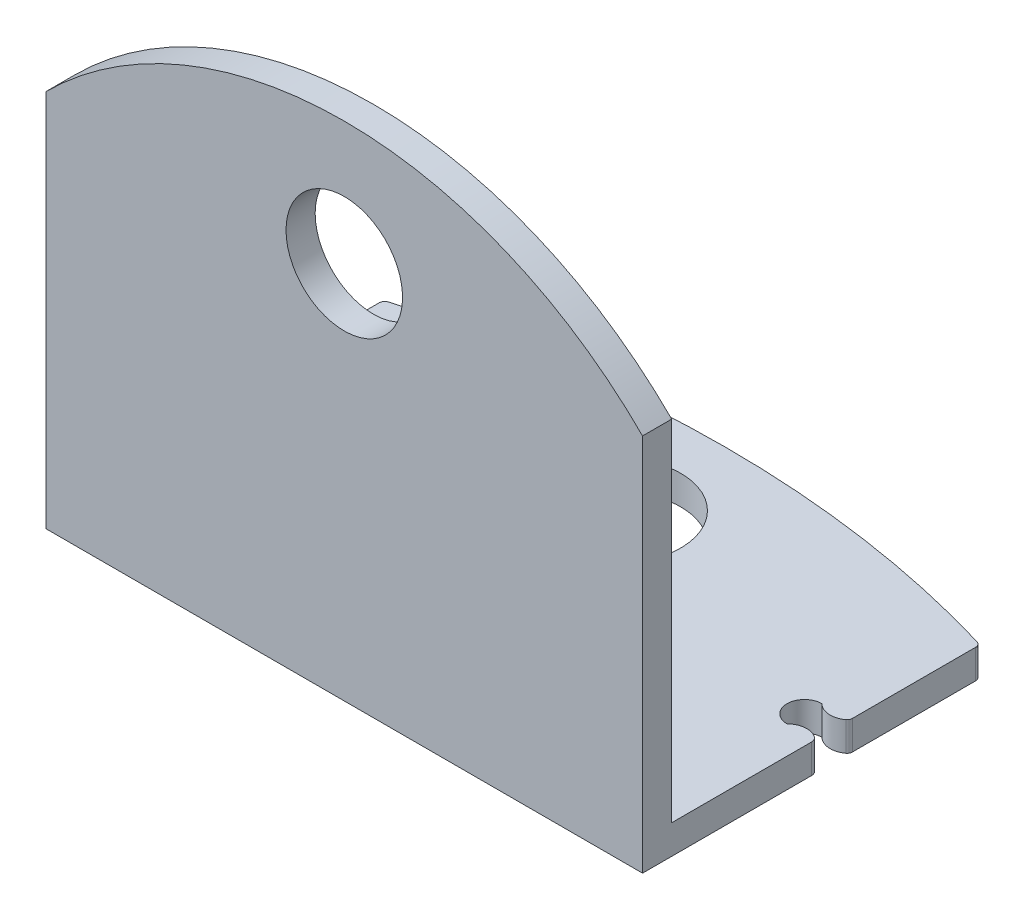
ISO-10303-21;
HEADER;
FILE_DESCRIPTION(('STEP AP214'),'2;1');
FILE_NAME('part.step','',(''),(''),'','','');
FILE_SCHEMA(('AUTOMOTIVE_DESIGN { 1 0 10303 214 1 1 1 1 }'));
ENDSEC;
DATA;
#1=APPLICATION_CONTEXT('core data for automotive mechanical design processes');
#2=APPLICATION_PROTOCOL_DEFINITION('international standard','automotive_design',2000,#1);
#3=PRODUCT_CONTEXT('',#1,'mechanical');
#4=PRODUCT('Part','Part','',(#3));
#5=PRODUCT_RELATED_PRODUCT_CATEGORY('part','',(#4));
#6=PRODUCT_DEFINITION_FORMATION('','',#4);
#7=PRODUCT_DEFINITION_CONTEXT('part definition',#1,'design');
#8=PRODUCT_DEFINITION('design','',#6,#7);
#9=PRODUCT_DEFINITION_SHAPE('','',#8);
#10=(LENGTH_UNIT() NAMED_UNIT(*) SI_UNIT(.MILLI.,.METRE.));
#11=(NAMED_UNIT(*) PLANE_ANGLE_UNIT() SI_UNIT($,.RADIAN.));
#12=(NAMED_UNIT(*) SI_UNIT($,.STERADIAN.) SOLID_ANGLE_UNIT());
#13=UNCERTAINTY_MEASURE_WITH_UNIT(LENGTH_MEASURE(1.E-05),#10,'distance_accuracy_value','');
#14=(GEOMETRIC_REPRESENTATION_CONTEXT(3) GLOBAL_UNCERTAINTY_ASSIGNED_CONTEXT((#13)) GLOBAL_UNIT_ASSIGNED_CONTEXT((#10,
#11,#12)) REPRESENTATION_CONTEXT('',''));
#15=CARTESIAN_POINT('',(0.,0.,0.));
#16=DIRECTION('',(0.,0.,1.));
#17=DIRECTION('',(1.,0.,0.));
#18=AXIS2_PLACEMENT_3D('',#15,#16,#17);
#19=CARTESIAN_POINT('',(-41.3120876337438,1.,-5.33762069757286));
#20=DIRECTION('',(0.,-1.,0.));
#21=DIRECTION('',(0.,0.,-1.));
#22=AXIS2_PLACEMENT_3D('',#19,#20,#21);
#23=PLANE('',#22);
#24=DIRECTION('',(0.,0.,1.));
#25=VECTOR('',#24,1.);
#26=CARTESIAN_POINT('',(-61.59208763374,1.,5.84119356993108));
#27=LINE('',#26,#25);
#28=CARTESIAN_POINT('',(-61.59208763374,1.,0.296178534774445));
#29=VERTEX_POINT('',#28);
#30=CARTESIAN_POINT('',(-61.59208763374,1.,5.0956472536764));
#31=VERTEX_POINT('',#30);
#32=EDGE_CURVE('E47',#29,#31,#27,.T.);
#33=ORIENTED_EDGE('',*,*,#32,.T.);
#34=DIRECTION('',(1.,0.,0.));
#35=VECTOR('',#34,1.);
#36=CARTESIAN_POINT('',(-41.3120876337438,1.,5.0956472536764));
#37=LINE('',#36,#35);
#38=CARTESIAN_POINT('',(-41.1120876337419,1.,5.0956472536764));
#39=VERTEX_POINT('',#38);
#40=EDGE_CURVE('E51',#31,#39,#37,.T.);
#41=ORIENTED_EDGE('',*,*,#40,.T.);
#42=DIRECTION('',(0.,0.,-1.));
#43=VECTOR('',#42,1.);
#44=CARTESIAN_POINT('',(-41.1120876337419,1.,0.296178534774445));
#45=LINE('',#44,#43);
#46=CARTESIAN_POINT('',(-41.1120876337419,1.,0.296178534774445));
#47=VERTEX_POINT('',#46);
#48=EDGE_CURVE('E173',#39,#47,#45,.T.);
#49=ORIENTED_EDGE('',*,*,#48,.T.);
#50=CARTESIAN_POINT('',(-41.3665413174872,1.,0.296178534774445));
#51=DIRECTION('',(0.,1.,0.));
#52=DIRECTION('',(0.,0.,-1.));
#53=AXIS2_PLACEMENT_3D('',#50,#51,#52);
#54=CIRCLE('',#53,0.254453683745325);
#55=CARTESIAN_POINT('',(-41.2313026112398,1.,0.0806392819593604));
#56=VERTEX_POINT('',#55);
#57=EDGE_CURVE('E232',#47,#56,#54,.T.);
#58=ORIENTED_EDGE('',*,*,#57,.T.);
#59=CARTESIAN_POINT('',(-41.5920876337419,1.,0.655647253676407));
#60=DIRECTION('',(0.,1.,0.));
#61=DIRECTION('',(0.,0.,1.));
#62=AXIS2_PLACEMENT_3D('',#59,#60,#61);
#63=CIRCLE('',#62,0.678822509939087);
#64=CARTESIAN_POINT('',(-42.0720876337419,1.,0.1756472536764));
#65=VERTEX_POINT('',#64);
#66=EDGE_CURVE('E234',#56,#65,#63,.T.);
#67=ORIENTED_EDGE('',*,*,#66,.T.);
#68=CARTESIAN_POINT('',(-42.0720876337419,1.,-0.424352746323596));
#69=DIRECTION('',(0.,-1.,0.));
#70=DIRECTION('',(0.,0.,-1.));
#71=AXIS2_PLACEMENT_3D('',#68,#69,#70);
#72=CIRCLE('',#71,0.6);
#73=CARTESIAN_POINT('',(-42.0720876337419,1.,-1.0243527463236));
#74=VERTEX_POINT('',#73);
#75=EDGE_CURVE('E236',#65,#74,#72,.T.);
#76=ORIENTED_EDGE('',*,*,#75,.T.);
#77=CARTESIAN_POINT('',(-41.5920876337419,1.,-1.5043527463236));
#78=DIRECTION('',(0.,1.,0.));
#79=DIRECTION('',(0.,0.,-1.));
#80=AXIS2_PLACEMENT_3D('',#77,#78,#79);
#81=CIRCLE('',#80,0.678822509939086);
#82=CARTESIAN_POINT('',(-41.1838326955143,1.,-0.962017144124402));
#83=VERTEX_POINT('',#82);
#84=EDGE_CURVE('E238',#74,#83,#81,.T.);
#85=ORIENTED_EDGE('',*,*,#84,.T.);
#86=CARTESIAN_POINT('',(-41.2920876337438,1.,-1.10582558737072));
#87=DIRECTION('',(0.,1.,0.));
#88=DIRECTION('',(0.,0.,-1.));
#89=AXIS2_PLACEMENT_3D('',#86,#87,#88);
#90=CIRCLE('',#89,0.18);
#91=CARTESIAN_POINT('',(-41.1120876337438,1.,-1.10582558737155));
#92=VERTEX_POINT('',#91);
#93=EDGE_CURVE('E240',#83,#92,#90,.T.);
#94=ORIENTED_EDGE('',*,*,#93,.T.);
#95=DIRECTION('',(0.,0.,-1.));
#96=VECTOR('',#95,1.);
#97=CARTESIAN_POINT('',(-41.1120876337438,1.,-5.33762069757286));
#98=LINE('',#97,#96);
#99=CARTESIAN_POINT('',(-41.1120876337438,1.,-5.33762069757286));
#100=VERTEX_POINT('',#99);
#101=EDGE_CURVE('E242',#92,#100,#98,.T.);
#102=ORIENTED_EDGE('',*,*,#101,.T.);
#103=CARTESIAN_POINT('',(-41.3120876337438,1.,-5.33762069757286));
#104=DIRECTION('',(0.,1.,0.));
#105=DIRECTION('',(0.,0.,-1.));
#106=AXIS2_PLACEMENT_3D('',#103,#104,#105);
#107=CIRCLE('',#106,0.199999999999998);
#108=CARTESIAN_POINT('',(-41.25522843489,1.,-5.52936800917255));
#109=VERTEX_POINT('',#108);
#110=EDGE_CURVE('E210',#100,#109,#107,.T.);
#111=ORIENTED_EDGE('',*,*,#110,.T.);
#112=CARTESIAN_POINT('',(-51.3520876337428,1.,28.5204541130068));
#113=DIRECTION('',(0.,1.,0.));
#114=DIRECTION('',(0.,0.,1.));
#115=AXIS2_PLACEMENT_3D('',#112,#113,#114);
#116=CIRCLE('',#115,35.5153058868077);
#117=CARTESIAN_POINT('',(-61.4489468325938,1.,-5.52936800917311));
#118=VERTEX_POINT('',#117);
#119=EDGE_CURVE('E213',#109,#118,#116,.T.);
#120=ORIENTED_EDGE('',*,*,#119,.T.);
#121=CARTESIAN_POINT('',(-61.39208763374,1.,-5.33762069757343));
#122=DIRECTION('',(0.,1.,0.));
#123=DIRECTION('',(0.,0.,-1.));
#124=AXIS2_PLACEMENT_3D('',#121,#122,#123);
#125=CIRCLE('',#124,0.199999999999998);
#126=CARTESIAN_POINT('',(-61.59208763374,1.,-5.33762069757343));
#127=VERTEX_POINT('',#126);
#128=EDGE_CURVE('E216',#118,#127,#125,.T.);
#129=ORIENTED_EDGE('',*,*,#128,.T.);
#130=DIRECTION('',(0.,0.,1.));
#131=VECTOR('',#130,1.);
#132=CARTESIAN_POINT('',(-61.59208763374,1.,-5.33762069757343));
#133=LINE('',#132,#131);
#134=CARTESIAN_POINT('',(-61.59208763374,1.,-1.10582558737213));
#135=VERTEX_POINT('',#134);
#136=EDGE_CURVE('E218',#127,#135,#133,.T.);
#137=ORIENTED_EDGE('',*,*,#136,.T.);
#138=CARTESIAN_POINT('',(-61.41208763374,1.,-1.10582558737213));
#139=DIRECTION('',(0.,1.,0.));
#140=DIRECTION('',(0.,0.,1.));
#141=AXIS2_PLACEMENT_3D('',#138,#139,#140);
#142=CIRCLE('',#141,0.18);
#143=CARTESIAN_POINT('',(-61.5203425719676,1.,-0.962017144124399));
#144=VERTEX_POINT('',#143);
#145=EDGE_CURVE('E220',#135,#144,#142,.T.);
#146=ORIENTED_EDGE('',*,*,#145,.T.);
#147=CARTESIAN_POINT('',(-61.11208763374,1.,-1.5043527463236));
#148=DIRECTION('',(0.,1.,0.));
#149=DIRECTION('',(0.,0.,1.));
#150=AXIS2_PLACEMENT_3D('',#147,#148,#149);
#151=CIRCLE('',#150,0.678822509939086);
#152=CARTESIAN_POINT('',(-60.63208763374,1.,-1.02435274632359));
#153=VERTEX_POINT('',#152);
#154=EDGE_CURVE('E222',#144,#153,#151,.T.);
#155=ORIENTED_EDGE('',*,*,#154,.T.);
#156=CARTESIAN_POINT('',(-60.63208763374,1.,-0.424352746323596));
#157=DIRECTION('',(0.,-1.,0.));
#158=DIRECTION('',(0.,0.,1.));
#159=AXIS2_PLACEMENT_3D('',#156,#157,#158);
#160=CIRCLE('',#159,0.6);
#161=CARTESIAN_POINT('',(-60.63208763374,1.,0.175647253676404));
#162=VERTEX_POINT('',#161);
#163=EDGE_CURVE('E224',#153,#162,#160,.T.);
#164=ORIENTED_EDGE('',*,*,#163,.T.);
#165=CARTESIAN_POINT('',(-61.11208763374,1.,0.655647253676407));
#166=DIRECTION('',(0.,1.,0.));
#167=DIRECTION('',(0.,0.,-1.));
#168=AXIS2_PLACEMENT_3D('',#165,#166,#167);
#169=CIRCLE('',#168,0.678822509939085);
#170=CARTESIAN_POINT('',(-61.4728726562421,1.,0.0806392819593631));
#171=VERTEX_POINT('',#170);
#172=EDGE_CURVE('E226',#162,#171,#169,.T.);
#173=ORIENTED_EDGE('',*,*,#172,.T.);
#174=CARTESIAN_POINT('',(-61.3376339499947,1.,0.296178534774445));
#175=DIRECTION('',(0.,1.,0.));
#176=DIRECTION('',(0.,0.,1.));
#177=AXIS2_PLACEMENT_3D('',#174,#175,#176);
#178=CIRCLE('',#177,0.254453683745325);
#179=EDGE_CURVE('E228',#171,#29,#178,.T.);
#180=ORIENTED_EDGE('',*,*,#179,.T.);
#181=EDGE_LOOP('',(#33,#41,#49,#58,#67,#76,#85,#94,#102,#111,#120,#129,#137,#146,#155,#164,#173,#180));
#182=FACE_BOUND('',#181,.T.);
#183=CARTESIAN_POINT('',(-51.3520876337419,1.,-3.2217231424722));
#184=DIRECTION('',(0.,1.,0.));
#185=DIRECTION('',(0.,0.,1.));
#186=AXIS2_PLACEMENT_3D('',#183,#184,#185);
#187=CIRCLE('',#186,2.22857889915405);
#188=CARTESIAN_POINT('',(-51.3520876337419,1.,-0.993144243318159));
#189=VERTEX_POINT('',#188);
#190=EDGE_CURVE('E204',#189,#189,#187,.T.);
#191=ORIENTED_EDGE('',*,*,#190,.F.);
#192=EDGE_LOOP('',(#191));
#193=FACE_BOUND('',#192,.T.);
#194=ADVANCED_FACE('F32',(#182,#193),#23,.F.);
#195=CARTESIAN_POINT('',(-41.3120876337438,0.,-5.33762069757286));
#196=DIRECTION('',(0.,-1.,0.));
#197=DIRECTION('',(0.,0.,-1.));
#198=AXIS2_PLACEMENT_3D('',#195,#196,#197);
#199=PLANE('',#198);
#200=CARTESIAN_POINT('',(-41.3665413174872,0.,0.296178534774445));
#201=DIRECTION('',(0.,1.,0.));
#202=DIRECTION('',(0.,0.,-1.));
#203=AXIS2_PLACEMENT_3D('',#200,#201,#202);
#204=CIRCLE('',#203,0.254453683745325);
#205=CARTESIAN_POINT('',(-41.1120876337419,0.,0.296178534774445));
#206=VERTEX_POINT('',#205);
#207=CARTESIAN_POINT('',(-41.2313026112398,0.,0.0806392819593604));
#208=VERTEX_POINT('',#207);
#209=EDGE_CURVE('E269',#206,#208,#204,.T.);
#210=ORIENTED_EDGE('',*,*,#209,.F.);
#211=DIRECTION('',(0.,0.,-1.));
#212=VECTOR('',#211,1.);
#213=CARTESIAN_POINT('',(-41.1120876337419,0.,0.296178534774445));
#214=LINE('',#213,#212);
#215=CARTESIAN_POINT('',(-41.1120876337419,0.,6.0956472536764));
#216=VERTEX_POINT('',#215);
#217=EDGE_CURVE('E267',#216,#206,#214,.T.);
#218=ORIENTED_EDGE('',*,*,#217,.F.);
#219=DIRECTION('',(1.,0.,0.));
#220=VECTOR('',#219,1.);
#221=CARTESIAN_POINT('',(-61.3376339499947,0.,6.0956472536764));
#222=LINE('',#221,#220);
#223=CARTESIAN_POINT('',(-61.59208763374,0.,6.0956472536764));
#224=VERTEX_POINT('',#223);
#225=EDGE_CURVE('E265',#224,#216,#222,.T.);
#226=ORIENTED_EDGE('',*,*,#225,.F.);
#227=DIRECTION('',(0.,0.,1.));
#228=VECTOR('',#227,1.);
#229=CARTESIAN_POINT('',(-61.59208763374,0.,5.84119356993108));
#230=LINE('',#229,#228);
#231=CARTESIAN_POINT('',(-61.59208763374,0.,0.296178534774445));
#232=VERTEX_POINT('',#231);
#233=EDGE_CURVE('E263',#232,#224,#230,.T.);
#234=ORIENTED_EDGE('',*,*,#233,.F.);
#235=CARTESIAN_POINT('',(-61.3376339499947,0.,0.296178534774445));
#236=DIRECTION('',(0.,1.,0.));
#237=DIRECTION('',(0.,0.,1.));
#238=AXIS2_PLACEMENT_3D('',#235,#236,#237);
#239=CIRCLE('',#238,0.254453683745325);
#240=CARTESIAN_POINT('',(-61.4728726562421,0.,0.0806392819593631));
#241=VERTEX_POINT('',#240);
#242=EDGE_CURVE('E261',#241,#232,#239,.T.);
#243=ORIENTED_EDGE('',*,*,#242,.F.);
#244=CARTESIAN_POINT('',(-61.11208763374,0.,0.655647253676407));
#245=DIRECTION('',(0.,1.,0.));
#246=DIRECTION('',(0.,0.,-1.));
#247=AXIS2_PLACEMENT_3D('',#244,#245,#246);
#248=CIRCLE('',#247,0.678822509939085);
#249=CARTESIAN_POINT('',(-60.63208763374,0.,0.175647253676404));
#250=VERTEX_POINT('',#249);
#251=EDGE_CURVE('E259',#250,#241,#248,.T.);
#252=ORIENTED_EDGE('',*,*,#251,.F.);
#253=CARTESIAN_POINT('',(-60.63208763374,0.,-0.424352746323596));
#254=DIRECTION('',(0.,-1.,0.));
#255=DIRECTION('',(0.,0.,1.));
#256=AXIS2_PLACEMENT_3D('',#253,#254,#255);
#257=CIRCLE('',#256,0.6);
#258=CARTESIAN_POINT('',(-60.63208763374,0.,-1.02435274632359));
#259=VERTEX_POINT('',#258);
#260=EDGE_CURVE('E257',#259,#250,#257,.T.);
#261=ORIENTED_EDGE('',*,*,#260,.F.);
#262=CARTESIAN_POINT('',(-61.11208763374,0.,-1.5043527463236));
#263=DIRECTION('',(0.,1.,0.));
#264=DIRECTION('',(0.,0.,1.));
#265=AXIS2_PLACEMENT_3D('',#262,#263,#264);
#266=CIRCLE('',#265,0.678822509939086);
#267=CARTESIAN_POINT('',(-61.5203425719676,0.,-0.962017144124399));
#268=VERTEX_POINT('',#267);
#269=EDGE_CURVE('E255',#268,#259,#266,.T.);
#270=ORIENTED_EDGE('',*,*,#269,.F.);
#271=CARTESIAN_POINT('',(-61.41208763374,0.,-1.10582558737213));
#272=DIRECTION('',(0.,1.,0.));
#273=DIRECTION('',(0.,0.,1.));
#274=AXIS2_PLACEMENT_3D('',#271,#272,#273);
#275=CIRCLE('',#274,0.18);
#276=CARTESIAN_POINT('',(-61.59208763374,0.,-1.10582558737213));
#277=VERTEX_POINT('',#276);
#278=EDGE_CURVE('E253',#277,#268,#275,.T.);
#279=ORIENTED_EDGE('',*,*,#278,.F.);
#280=DIRECTION('',(0.,0.,1.));
#281=VECTOR('',#280,1.);
#282=CARTESIAN_POINT('',(-61.59208763374,0.,-5.33762069757343));
#283=LINE('',#282,#281);
#284=CARTESIAN_POINT('',(-61.59208763374,0.,-5.33762069757343));
#285=VERTEX_POINT('',#284);
#286=EDGE_CURVE('E251',#285,#277,#283,.T.);
#287=ORIENTED_EDGE('',*,*,#286,.F.);
#288=CARTESIAN_POINT('',(-61.39208763374,0.,-5.33762069757343));
#289=DIRECTION('',(0.,1.,0.));
#290=DIRECTION('',(0.,0.,-1.));
#291=AXIS2_PLACEMENT_3D('',#288,#289,#290);
#292=CIRCLE('',#291,0.199999999999998);
#293=CARTESIAN_POINT('',(-61.4489468325938,0.,-5.52936800917311));
#294=VERTEX_POINT('',#293);
#295=EDGE_CURVE('E249',#294,#285,#292,.T.);
#296=ORIENTED_EDGE('',*,*,#295,.F.);
#297=CARTESIAN_POINT('',(-51.3520876337428,0.,28.5204541130068));
#298=DIRECTION('',(0.,1.,0.));
#299=DIRECTION('',(0.,0.,1.));
#300=AXIS2_PLACEMENT_3D('',#297,#298,#299);
#301=CIRCLE('',#300,35.5153058868077);
#302=CARTESIAN_POINT('',(-41.25522843489,0.,-5.52936800917255));
#303=VERTEX_POINT('',#302);
#304=EDGE_CURVE('E247',#303,#294,#301,.T.);
#305=ORIENTED_EDGE('',*,*,#304,.F.);
#306=CARTESIAN_POINT('',(-41.3120876337438,0.,-5.33762069757286));
#307=DIRECTION('',(0.,1.,0.));
#308=DIRECTION('',(0.,0.,-1.));
#309=AXIS2_PLACEMENT_3D('',#306,#307,#308);
#310=CIRCLE('',#309,0.199999999999998);
#311=CARTESIAN_POINT('',(-41.1120876337438,0.,-5.33762069757286));
#312=VERTEX_POINT('',#311);
#313=EDGE_CURVE('E207',#312,#303,#310,.T.);
#314=ORIENTED_EDGE('',*,*,#313,.F.);
#315=DIRECTION('',(0.,0.,-1.));
#316=VECTOR('',#315,1.);
#317=CARTESIAN_POINT('',(-41.1120876337438,0.,-5.33762069757286));
#318=LINE('',#317,#316);
#319=CARTESIAN_POINT('',(-41.1120876337438,0.,-1.10582558737155));
#320=VERTEX_POINT('',#319);
#321=EDGE_CURVE('E214',#320,#312,#318,.T.);
#322=ORIENTED_EDGE('',*,*,#321,.F.);
#323=CARTESIAN_POINT('',(-41.2920876337438,0.,-1.10582558737072));
#324=DIRECTION('',(0.,1.,0.));
#325=DIRECTION('',(0.,0.,-1.));
#326=AXIS2_PLACEMENT_3D('',#323,#324,#325);
#327=CIRCLE('',#326,0.18);
#328=CARTESIAN_POINT('',(-41.1838326955143,0.,-0.962017144124402));
#329=VERTEX_POINT('',#328);
#330=EDGE_CURVE('E277',#329,#320,#327,.T.);
#331=ORIENTED_EDGE('',*,*,#330,.F.);
#332=CARTESIAN_POINT('',(-41.5920876337419,0.,-1.5043527463236));
#333=DIRECTION('',(0.,1.,0.));
#334=DIRECTION('',(0.,0.,-1.));
#335=AXIS2_PLACEMENT_3D('',#332,#333,#334);
#336=CIRCLE('',#335,0.678822509939086);
#337=CARTESIAN_POINT('',(-42.0720876337419,0.,-1.0243527463236));
#338=VERTEX_POINT('',#337);
#339=EDGE_CURVE('E275',#338,#329,#336,.T.);
#340=ORIENTED_EDGE('',*,*,#339,.F.);
#341=CARTESIAN_POINT('',(-42.0720876337419,0.,-0.424352746323596));
#342=DIRECTION('',(0.,-1.,0.));
#343=DIRECTION('',(0.,0.,-1.));
#344=AXIS2_PLACEMENT_3D('',#341,#342,#343);
#345=CIRCLE('',#344,0.6);
#346=CARTESIAN_POINT('',(-42.0720876337419,0.,0.1756472536764));
#347=VERTEX_POINT('',#346);
#348=EDGE_CURVE('E273',#347,#338,#345,.T.);
#349=ORIENTED_EDGE('',*,*,#348,.F.);
#350=CARTESIAN_POINT('',(-41.5920876337419,0.,0.655647253676407));
#351=DIRECTION('',(0.,1.,0.));
#352=DIRECTION('',(0.,0.,1.));
#353=AXIS2_PLACEMENT_3D('',#350,#351,#352);
#354=CIRCLE('',#353,0.678822509939087);
#355=EDGE_CURVE('E271',#208,#347,#354,.T.);
#356=ORIENTED_EDGE('',*,*,#355,.F.);
#357=EDGE_LOOP('',(#210,#218,#226,#234,#243,#252,#261,#270,#279,#287,#296,#305,#314,#322,#331,
#340,#349,#356));
#358=FACE_BOUND('',#357,.T.);
#359=CARTESIAN_POINT('',(-51.3520876337419,0.,-3.2217231424722));
#360=DIRECTION('',(0.,1.,0.));
#361=DIRECTION('',(0.,0.,1.));
#362=AXIS2_PLACEMENT_3D('',#359,#360,#361);
#363=CIRCLE('',#362,2.22857889915405);
#364=CARTESIAN_POINT('',(-51.3520876337419,0.,-0.993144243318159));
#365=VERTEX_POINT('',#364);
#366=EDGE_CURVE('E203',#365,#365,#363,.T.);
#367=ORIENTED_EDGE('',*,*,#366,.T.);
#368=EDGE_LOOP('',(#367));
#369=FACE_BOUND('',#368,.T.);
#370=ADVANCED_FACE('F331',(#358,#369),#199,.T.);
#371=CARTESIAN_POINT('',(-41.3120876337438,1.,-5.33762069757286));
#372=DIRECTION('',(0.,-1.,0.));
#373=DIRECTION('',(0.,0.,-1.));
#374=AXIS2_PLACEMENT_3D('',#371,#372,#373);
#375=CYLINDRICAL_SURFACE('',#374,0.199999999999998);
#376=ORIENTED_EDGE('',*,*,#313,.T.);
#377=DIRECTION('',(0.,-1.,0.));
#378=VECTOR('',#377,1.);
#379=CARTESIAN_POINT('',(-41.25522843489,1.,-5.52936800917255));
#380=LINE('',#379,#378);
#381=EDGE_CURVE('E11',#109,#303,#380,.T.);
#382=ORIENTED_EDGE('',*,*,#381,.F.);
#383=ORIENTED_EDGE('',*,*,#110,.F.);
#384=DIRECTION('',(0.,-1.,0.));
#385=VECTOR('',#384,1.);
#386=CARTESIAN_POINT('',(-41.1120876337438,1.,-5.33762069757286));
#387=LINE('',#386,#385);
#388=EDGE_CURVE('E244',#100,#312,#387,.T.);
#389=ORIENTED_EDGE('',*,*,#388,.T.);
#390=EDGE_LOOP('',(#376,#382,#383,#389));
#391=FACE_BOUND('',#390,.T.);
#392=ADVANCED_FACE('F34',(#391),#375,.T.);
#393=CARTESIAN_POINT('',(-51.3520876337428,1.,28.5204541130068));
#394=DIRECTION('',(0.,-1.,0.));
#395=DIRECTION('',(0.,0.,-1.));
#396=AXIS2_PLACEMENT_3D('',#393,#394,#395);
#397=CYLINDRICAL_SURFACE('',#396,35.5153058868077);
#398=ORIENTED_EDGE('',*,*,#304,.T.);
#399=DIRECTION('',(0.,-1.,0.));
#400=VECTOR('',#399,1.);
#401=CARTESIAN_POINT('',(-61.4489468325938,1.,-5.52936800917311));
#402=LINE('',#401,#400);
#403=EDGE_CURVE('E40',#118,#294,#402,.T.);
#404=ORIENTED_EDGE('',*,*,#403,.F.);
#405=ORIENTED_EDGE('',*,*,#119,.F.);
#406=ORIENTED_EDGE('',*,*,#381,.T.);
#407=EDGE_LOOP('',(#398,#404,#405,#406));
#408=FACE_BOUND('',#407,.T.);
#409=ADVANCED_FACE('F349',(#408),#397,.T.);
#410=CARTESIAN_POINT('',(-61.39208763374,1.,-5.33762069757343));
#411=DIRECTION('',(0.,-1.,0.));
#412=DIRECTION('',(0.,0.,-1.));
#413=AXIS2_PLACEMENT_3D('',#410,#411,#412);
#414=CYLINDRICAL_SURFACE('',#413,0.199999999999998);
#415=ORIENTED_EDGE('',*,*,#295,.T.);
#416=DIRECTION('',(0.,-1.,0.));
#417=VECTOR('',#416,1.);
#418=CARTESIAN_POINT('',(-61.59208763374,1.,-5.33762069757343));
#419=LINE('',#418,#417);
#420=EDGE_CURVE('E318',#127,#285,#419,.T.);
#421=ORIENTED_EDGE('',*,*,#420,.F.);
#422=ORIENTED_EDGE('',*,*,#128,.F.);
#423=ORIENTED_EDGE('',*,*,#403,.T.);
#424=EDGE_LOOP('',(#415,#421,#422,#423));
#425=FACE_BOUND('',#424,.T.);
#426=ADVANCED_FACE('F325',(#425),#414,.T.);
#427=CARTESIAN_POINT('',(-61.59208763374,1.,-5.33762069757343));
#428=DIRECTION('',(1.,0.,0.));
#429=DIRECTION('',(0.,0.,-1.));
#430=AXIS2_PLACEMENT_3D('',#427,#428,#429);
#431=PLANE('',#430);
#432=ORIENTED_EDGE('',*,*,#286,.T.);
#433=DIRECTION('',(0.,-1.,0.));
#434=VECTOR('',#433,1.);
#435=CARTESIAN_POINT('',(-61.59208763374,1.,-1.10582558737213));
#436=LINE('',#435,#434);
#437=EDGE_CURVE('E315',#135,#277,#436,.T.);
#438=ORIENTED_EDGE('',*,*,#437,.F.);
#439=ORIENTED_EDGE('',*,*,#136,.F.);
#440=ORIENTED_EDGE('',*,*,#420,.T.);
#441=EDGE_LOOP('',(#432,#438,#439,#440));
#442=FACE_BOUND('',#441,.T.);
#443=ADVANCED_FACE('F338',(#442),#431,.F.);
#444=CARTESIAN_POINT('',(-61.41208763374,1.,-1.10582558737213));
#445=DIRECTION('',(0.,-1.,0.));
#446=DIRECTION('',(0.,0.,-1.));
#447=AXIS2_PLACEMENT_3D('',#444,#445,#446);
#448=CYLINDRICAL_SURFACE('',#447,0.18);
#449=ORIENTED_EDGE('',*,*,#278,.T.);
#450=DIRECTION('',(0.,-1.,0.));
#451=VECTOR('',#450,1.);
#452=CARTESIAN_POINT('',(-61.5203425719676,1.,-0.962017144124399));
#453=LINE('',#452,#451);
#454=EDGE_CURVE('E312',#144,#268,#453,.T.);
#455=ORIENTED_EDGE('',*,*,#454,.F.);
#456=ORIENTED_EDGE('',*,*,#145,.F.);
#457=ORIENTED_EDGE('',*,*,#437,.T.);
#458=EDGE_LOOP('',(#449,#455,#456,#457));
#459=FACE_BOUND('',#458,.T.);
#460=ADVANCED_FACE('F342',(#459),#448,.T.);
#461=CARTESIAN_POINT('',(-61.11208763374,1.,-1.5043527463236));
#462=DIRECTION('',(0.,-1.,0.));
#463=DIRECTION('',(0.,0.,-1.));
#464=AXIS2_PLACEMENT_3D('',#461,#462,#463);
#465=CYLINDRICAL_SURFACE('',#464,0.678822509939086);
#466=ORIENTED_EDGE('',*,*,#269,.T.);
#467=DIRECTION('',(0.,-1.,0.));
#468=VECTOR('',#467,1.);
#469=CARTESIAN_POINT('',(-60.63208763374,1.,-1.02435274632359));
#470=LINE('',#469,#468);
#471=EDGE_CURVE('E309',#153,#259,#470,.T.);
#472=ORIENTED_EDGE('',*,*,#471,.F.);
#473=ORIENTED_EDGE('',*,*,#154,.F.);
#474=ORIENTED_EDGE('',*,*,#454,.T.);
#475=EDGE_LOOP('',(#466,#472,#473,#474));
#476=FACE_BOUND('',#475,.T.);
#477=ADVANCED_FACE('F404',(#476),#465,.T.);
#478=CARTESIAN_POINT('',(-60.63208763374,1.,-0.424352746323596));
#479=DIRECTION('',(0.,-1.,0.));
#480=DIRECTION('',(0.,0.,-1.));
#481=AXIS2_PLACEMENT_3D('',#478,#479,#480);
#482=CYLINDRICAL_SURFACE('',#481,0.6);
#483=ORIENTED_EDGE('',*,*,#260,.T.);
#484=DIRECTION('',(0.,-1.,0.));
#485=VECTOR('',#484,1.);
#486=CARTESIAN_POINT('',(-60.63208763374,1.,0.175647253676404));
#487=LINE('',#486,#485);
#488=EDGE_CURVE('E306',#162,#250,#487,.T.);
#489=ORIENTED_EDGE('',*,*,#488,.F.);
#490=ORIENTED_EDGE('',*,*,#163,.F.);
#491=ORIENTED_EDGE('',*,*,#471,.T.);
#492=EDGE_LOOP('',(#483,#489,#490,#491));
#493=FACE_BOUND('',#492,.T.);
#494=ADVANCED_FACE('F402',(#493),#482,.F.);
#495=CARTESIAN_POINT('',(-61.11208763374,1.,0.655647253676407));
#496=DIRECTION('',(0.,-1.,0.));
#497=DIRECTION('',(0.,0.,-1.));
#498=AXIS2_PLACEMENT_3D('',#495,#496,#497);
#499=CYLINDRICAL_SURFACE('',#498,0.678822509939085);
#500=ORIENTED_EDGE('',*,*,#251,.T.);
#501=DIRECTION('',(0.,-1.,0.));
#502=VECTOR('',#501,1.);
#503=CARTESIAN_POINT('',(-61.4728726562421,1.,0.0806392819593631));
#504=LINE('',#503,#502);
#505=EDGE_CURVE('E303',#171,#241,#504,.T.);
#506=ORIENTED_EDGE('',*,*,#505,.F.);
#507=ORIENTED_EDGE('',*,*,#172,.F.);
#508=ORIENTED_EDGE('',*,*,#488,.T.);
#509=EDGE_LOOP('',(#500,#506,#507,#508));
#510=FACE_BOUND('',#509,.T.);
#511=ADVANCED_FACE('F398',(#510),#499,.T.);
#512=CARTESIAN_POINT('',(-61.3376339499947,1.,0.296178534774445));
#513=DIRECTION('',(0.,-1.,0.));
#514=DIRECTION('',(0.,0.,-1.));
#515=AXIS2_PLACEMENT_3D('',#512,#513,#514);
#516=CYLINDRICAL_SURFACE('',#515,0.254453683745325);
#517=ORIENTED_EDGE('',*,*,#242,.T.);
#518=DIRECTION('',(0.,-1.,0.));
#519=VECTOR('',#518,1.);
#520=CARTESIAN_POINT('',(-61.59208763374,1.,0.296178534774445));
#521=LINE('',#520,#519);
#522=EDGE_CURVE('E300',#29,#232,#521,.T.);
#523=ORIENTED_EDGE('',*,*,#522,.F.);
#524=ORIENTED_EDGE('',*,*,#179,.F.);
#525=ORIENTED_EDGE('',*,*,#505,.T.);
#526=EDGE_LOOP('',(#517,#523,#524,#525));
#527=FACE_BOUND('',#526,.T.);
#528=ADVANCED_FACE('F393',(#527),#516,.T.);
#529=CARTESIAN_POINT('',(-61.59208763374,1.,5.84119356993108));
#530=DIRECTION('',(1.,0.,0.));
#531=DIRECTION('',(0.,0.,-1.));
#532=AXIS2_PLACEMENT_3D('',#529,#530,#531);
#533=PLANE('',#532);
#534=DIRECTION('',(0.,-1.,0.));
#535=VECTOR('',#534,1.);
#536=CARTESIAN_POINT('',(-61.59208763374,0.,5.0956472536764));
#537=LINE('',#536,#535);
#538=CARTESIAN_POINT('',(-61.59208763374,13.,5.0956472536764));
#539=VERTEX_POINT('',#538);
#540=EDGE_CURVE('E187',#539,#31,#537,.T.);
#541=ORIENTED_EDGE('',*,*,#540,.T.);
#542=ORIENTED_EDGE('',*,*,#32,.F.);
#543=ORIENTED_EDGE('',*,*,#522,.T.);
#544=ORIENTED_EDGE('',*,*,#233,.T.);
#545=DIRECTION('',(0.,-1.,0.));
#546=VECTOR('',#545,1.);
#547=CARTESIAN_POINT('',(-61.59208763374,0.,6.0956472536764));
#548=LINE('',#547,#546);
#549=CARTESIAN_POINT('',(-61.59208763374,13.,6.0956472536764));
#550=VERTEX_POINT('',#549);
#551=EDGE_CURVE('E177',#550,#224,#548,.T.);
#552=ORIENTED_EDGE('',*,*,#551,.F.);
#553=DIRECTION('',(0.,0.,1.));
#554=VECTOR('',#553,1.);
#555=CARTESIAN_POINT('',(-61.59208763374,13.,5.0956472536764));
#556=LINE('',#555,#554);
#557=EDGE_CURVE('E186',#539,#550,#556,.T.);
#558=ORIENTED_EDGE('',*,*,#557,.F.);
#559=EDGE_LOOP('',(#541,#542,#543,#544,#552,#558));
#560=FACE_BOUND('',#559,.T.);
#561=ADVANCED_FACE('F387',(#560),#533,.F.);
#562=CARTESIAN_POINT('',(-61.3376339499947,1.,6.0956472536764));
#563=DIRECTION('',(0.,0.,-1.));
#564=DIRECTION('',(-1.,0.,0.));
#565=AXIS2_PLACEMENT_3D('',#562,#563,#564);
#566=PLANE('',#565);
#567=CARTESIAN_POINT('',(-51.352087633741,13.,6.0956472536764));
#568=DIRECTION('',(0.,0.,-1.));
#569=DIRECTION('',(-1.,0.,0.));
#570=AXIS2_PLACEMENT_3D('',#567,#568,#569);
#571=CIRCLE('',#570,2.);
#572=CARTESIAN_POINT('',(-53.352087633741,13.,6.0956472536764));
#573=VERTEX_POINT('',#572);
#574=EDGE_CURVE('E197',#573,#573,#571,.T.);
#575=ORIENTED_EDGE('',*,*,#574,.T.);
#576=EDGE_LOOP('',(#575));
#577=FACE_BOUND('',#576,.T.);
#578=ORIENTED_EDGE('',*,*,#551,.T.);
#579=ORIENTED_EDGE('',*,*,#225,.T.);
#580=DIRECTION('',(0.,1.,0.));
#581=VECTOR('',#580,1.);
#582=CARTESIAN_POINT('',(-41.1120876337419,0.,6.0956472536764));
#583=LINE('',#582,#581);
#584=CARTESIAN_POINT('',(-41.1120876337419,13.,6.0956472536764));
#585=VERTEX_POINT('',#584);
#586=EDGE_CURVE('E195',#216,#585,#583,.T.);
#587=ORIENTED_EDGE('',*,*,#586,.T.);
#588=CARTESIAN_POINT('',(-51.352087633741,2.76000000000093,6.0956472536764));
#589=DIRECTION('',(0.,0.,1.));
#590=DIRECTION('',(-1.,0.,0.));
#591=AXIS2_PLACEMENT_3D('',#588,#589,#590);
#592=CIRCLE('',#591,14.4815468786992);
#593=EDGE_CURVE('E184',#585,#550,#592,.T.);
#594=ORIENTED_EDGE('',*,*,#593,.T.);
#595=EDGE_LOOP('',(#578,#579,#587,#594));
#596=FACE_BOUND('',#595,.T.);
#597=ADVANCED_FACE('F384',(#577,#596),#566,.F.);
#598=CARTESIAN_POINT('',(-41.1120876337419,1.,0.296178534774445));
#599=DIRECTION('',(-1.,0.,0.));
#600=DIRECTION('',(0.,0.,1.));
#601=AXIS2_PLACEMENT_3D('',#598,#599,#600);
#602=PLANE('',#601);
#603=ORIENTED_EDGE('',*,*,#48,.F.);
#604=DIRECTION('',(0.,1.,0.));
#605=VECTOR('',#604,1.);
#606=CARTESIAN_POINT('',(-41.1120876337419,0.,5.0956472536764));
#607=LINE('',#606,#605);
#608=CARTESIAN_POINT('',(-41.1120876337419,13.,5.0956472536764));
#609=VERTEX_POINT('',#608);
#610=EDGE_CURVE('E166',#39,#609,#607,.T.);
#611=ORIENTED_EDGE('',*,*,#610,.T.);
#612=DIRECTION('',(0.,0.,1.));
#613=VECTOR('',#612,1.);
#614=CARTESIAN_POINT('',(-41.1120876337419,13.,5.0956472536764));
#615=LINE('',#614,#613);
#616=EDGE_CURVE('E170',#609,#585,#615,.T.);
#617=ORIENTED_EDGE('',*,*,#616,.T.);
#618=ORIENTED_EDGE('',*,*,#586,.F.);
#619=ORIENTED_EDGE('',*,*,#217,.T.);
#620=DIRECTION('',(0.,-1.,0.));
#621=VECTOR('',#620,1.);
#622=CARTESIAN_POINT('',(-41.1120876337419,1.,0.296178534774445));
#623=LINE('',#622,#621);
#624=EDGE_CURVE('E297',#47,#206,#623,.T.);
#625=ORIENTED_EDGE('',*,*,#624,.F.);
#626=EDGE_LOOP('',(#603,#611,#617,#618,#619,#625));
#627=FACE_BOUND('',#626,.T.);
#628=ADVANCED_FACE('F168',(#627),#602,.F.);
#629=CARTESIAN_POINT('',(-41.3665413174872,1.,0.296178534774445));
#630=DIRECTION('',(0.,-1.,0.));
#631=DIRECTION('',(0.,0.,-1.));
#632=AXIS2_PLACEMENT_3D('',#629,#630,#631);
#633=CYLINDRICAL_SURFACE('',#632,0.254453683745325);
#634=ORIENTED_EDGE('',*,*,#209,.T.);
#635=DIRECTION('',(0.,-1.,0.));
#636=VECTOR('',#635,1.);
#637=CARTESIAN_POINT('',(-41.2313026112398,1.,0.0806392819593604));
#638=LINE('',#637,#636);
#639=EDGE_CURVE('E294',#56,#208,#638,.T.);
#640=ORIENTED_EDGE('',*,*,#639,.F.);
#641=ORIENTED_EDGE('',*,*,#57,.F.);
#642=ORIENTED_EDGE('',*,*,#624,.T.);
#643=EDGE_LOOP('',(#634,#640,#641,#642));
#644=FACE_BOUND('',#643,.T.);
#645=ADVANCED_FACE('F379',(#644),#633,.T.);
#646=CARTESIAN_POINT('',(-41.5920876337419,1.,0.655647253676407));
#647=DIRECTION('',(0.,-1.,0.));
#648=DIRECTION('',(0.,0.,-1.));
#649=AXIS2_PLACEMENT_3D('',#646,#647,#648);
#650=CYLINDRICAL_SURFACE('',#649,0.678822509939087);
#651=ORIENTED_EDGE('',*,*,#355,.T.);
#652=DIRECTION('',(0.,-1.,0.));
#653=VECTOR('',#652,1.);
#654=CARTESIAN_POINT('',(-42.0720876337419,1.,0.1756472536764));
#655=LINE('',#654,#653);
#656=EDGE_CURVE('E291',#65,#347,#655,.T.);
#657=ORIENTED_EDGE('',*,*,#656,.F.);
#658=ORIENTED_EDGE('',*,*,#66,.F.);
#659=ORIENTED_EDGE('',*,*,#639,.T.);
#660=EDGE_LOOP('',(#651,#657,#658,#659));
#661=FACE_BOUND('',#660,.T.);
#662=ADVANCED_FACE('F375',(#661),#650,.T.);
#663=CARTESIAN_POINT('',(-42.0720876337419,1.,-0.424352746323596));
#664=DIRECTION('',(0.,-1.,0.));
#665=DIRECTION('',(0.,0.,-1.));
#666=AXIS2_PLACEMENT_3D('',#663,#664,#665);
#667=CYLINDRICAL_SURFACE('',#666,0.6);
#668=ORIENTED_EDGE('',*,*,#348,.T.);
#669=DIRECTION('',(0.,-1.,0.));
#670=VECTOR('',#669,1.);
#671=CARTESIAN_POINT('',(-42.0720876337419,1.,-1.0243527463236));
#672=LINE('',#671,#670);
#673=EDGE_CURVE('E288',#74,#338,#672,.T.);
#674=ORIENTED_EDGE('',*,*,#673,.F.);
#675=ORIENTED_EDGE('',*,*,#75,.F.);
#676=ORIENTED_EDGE('',*,*,#656,.T.);
#677=EDGE_LOOP('',(#668,#674,#675,#676));
#678=FACE_BOUND('',#677,.T.);
#679=ADVANCED_FACE('F370',(#678),#667,.F.);
#680=CARTESIAN_POINT('',(-41.5920876337419,1.,-1.5043527463236));
#681=DIRECTION('',(0.,-1.,0.));
#682=DIRECTION('',(0.,0.,-1.));
#683=AXIS2_PLACEMENT_3D('',#680,#681,#682);
#684=CYLINDRICAL_SURFACE('',#683,0.678822509939086);
#685=ORIENTED_EDGE('',*,*,#339,.T.);
#686=DIRECTION('',(0.,-1.,0.));
#687=VECTOR('',#686,1.);
#688=CARTESIAN_POINT('',(-41.1838326955143,1.,-0.962017144124402));
#689=LINE('',#688,#687);
#690=EDGE_CURVE('E285',#83,#329,#689,.T.);
#691=ORIENTED_EDGE('',*,*,#690,.F.);
#692=ORIENTED_EDGE('',*,*,#84,.F.);
#693=ORIENTED_EDGE('',*,*,#673,.T.);
#694=EDGE_LOOP('',(#685,#691,#692,#693));
#695=FACE_BOUND('',#694,.T.);
#696=ADVANCED_FACE('F365',(#695),#684,.T.);
#697=CARTESIAN_POINT('',(-41.2920876337438,1.,-1.10582558737072));
#698=DIRECTION('',(0.,-1.,0.));
#699=DIRECTION('',(0.,0.,-1.));
#700=AXIS2_PLACEMENT_3D('',#697,#698,#699);
#701=CYLINDRICAL_SURFACE('',#700,0.18);
#702=ORIENTED_EDGE('',*,*,#330,.T.);
#703=DIRECTION('',(0.,-1.,0.));
#704=VECTOR('',#703,1.);
#705=CARTESIAN_POINT('',(-41.1120876337438,1.,-1.10582558737155));
#706=LINE('',#705,#704);
#707=EDGE_CURVE('E282',#92,#320,#706,.T.);
#708=ORIENTED_EDGE('',*,*,#707,.F.);
#709=ORIENTED_EDGE('',*,*,#93,.F.);
#710=ORIENTED_EDGE('',*,*,#690,.T.);
#711=EDGE_LOOP('',(#702,#708,#709,#710));
#712=FACE_BOUND('',#711,.T.);
#713=ADVANCED_FACE('F361',(#712),#701,.T.);
#714=CARTESIAN_POINT('',(-41.1120876337438,1.,-5.33762069757286));
#715=DIRECTION('',(-1.,0.,0.));
#716=DIRECTION('',(0.,0.,1.));
#717=AXIS2_PLACEMENT_3D('',#714,#715,#716);
#718=PLANE('',#717);
#719=ORIENTED_EDGE('',*,*,#321,.T.);
#720=ORIENTED_EDGE('',*,*,#388,.F.);
#721=ORIENTED_EDGE('',*,*,#101,.F.);
#722=ORIENTED_EDGE('',*,*,#707,.T.);
#723=EDGE_LOOP('',(#719,#720,#721,#722));
#724=FACE_BOUND('',#723,.T.);
#725=ADVANCED_FACE('F356',(#724),#718,.F.);
#726=CARTESIAN_POINT('',(-51.3520876337419,1.,-3.2217231424722));
#727=DIRECTION('',(0.,-1.,0.));
#728=DIRECTION('',(0.,0.,-1.));
#729=AXIS2_PLACEMENT_3D('',#726,#727,#728);
#730=CYLINDRICAL_SURFACE('',#729,2.22857889915405);
#731=ORIENTED_EDGE('',*,*,#190,.T.);
#732=EDGE_LOOP('',(#731));
#733=FACE_BOUND('',#732,.T.);
#734=ORIENTED_EDGE('',*,*,#366,.F.);
#735=EDGE_LOOP('',(#734));
#736=FACE_BOUND('',#735,.T.);
#737=ADVANCED_FACE('F420',(#733,#736),#730,.F.);
#738=CARTESIAN_POINT('',(-51.352087633741,2.76000000000093,5.0956472536764));
#739=DIRECTION('',(0.,0.,-1.));
#740=DIRECTION('',(-1.,0.,0.));
#741=AXIS2_PLACEMENT_3D('',#738,#739,#740);
#742=PLANE('',#741);
#743=CARTESIAN_POINT('',(-51.352087633741,13.,5.0956472536764));
#744=DIRECTION('',(0.,0.,-1.));
#745=DIRECTION('',(-1.,0.,0.));
#746=AXIS2_PLACEMENT_3D('',#743,#744,#745);
#747=CIRCLE('',#746,2.);
#748=CARTESIAN_POINT('',(-53.352087633741,13.,5.0956472536764));
#749=VERTEX_POINT('',#748);
#750=EDGE_CURVE('E616',#749,#749,#747,.T.);
#751=ORIENTED_EDGE('',*,*,#750,.F.);
#752=EDGE_LOOP('',(#751));
#753=FACE_BOUND('',#752,.T.);
#754=ORIENTED_EDGE('',*,*,#40,.F.);
#755=ORIENTED_EDGE('',*,*,#540,.F.);
#756=CARTESIAN_POINT('',(-51.352087633741,2.76000000000093,5.0956472536764));
#757=DIRECTION('',(0.,0.,1.));
#758=DIRECTION('',(-1.,0.,0.));
#759=AXIS2_PLACEMENT_3D('',#756,#757,#758);
#760=CIRCLE('',#759,14.4815468786992);
#761=EDGE_CURVE('E176',#609,#539,#760,.T.);
#762=ORIENTED_EDGE('',*,*,#761,.F.);
#763=ORIENTED_EDGE('',*,*,#610,.F.);
#764=EDGE_LOOP('',(#754,#755,#762,#763));
#765=FACE_BOUND('',#764,.T.);
#766=ADVANCED_FACE('F189',(#753,#765),#742,.T.);
#767=CARTESIAN_POINT('',(-51.352087633741,2.76000000000093,5.0956472536764));
#768=DIRECTION('',(0.,0.,1.));
#769=DIRECTION('',(1.,0.,0.));
#770=AXIS2_PLACEMENT_3D('',#767,#768,#769);
#771=CYLINDRICAL_SURFACE('',#770,14.4815468786992);
#772=ORIENTED_EDGE('',*,*,#593,.F.);
#773=ORIENTED_EDGE('',*,*,#616,.F.);
#774=ORIENTED_EDGE('',*,*,#761,.T.);
#775=ORIENTED_EDGE('',*,*,#557,.T.);
#776=EDGE_LOOP('',(#772,#773,#774,#775));
#777=FACE_BOUND('',#776,.T.);
#778=ADVANCED_FACE('F181',(#777),#771,.T.);
#779=CARTESIAN_POINT('',(-51.352087633741,13.,12.0956472536764));
#780=DIRECTION('',(0.,0.,-1.));
#781=DIRECTION('',(-1.,0.,0.));
#782=AXIS2_PLACEMENT_3D('',#779,#780,#781);
#783=CYLINDRICAL_SURFACE('',#782,2.);
#784=ORIENTED_EDGE('',*,*,#750,.T.);
#785=EDGE_LOOP('',(#784));
#786=FACE_BOUND('',#785,.T.);
#787=ORIENTED_EDGE('',*,*,#574,.F.);
#788=EDGE_LOOP('',(#787));
#789=FACE_BOUND('',#788,.T.);
#790=ADVANCED_FACE('F510',(#786,#789),#783,.F.);
#791=CLOSED_SHELL('',(#194,#370,#392,#409,#426,#443,#460,#477,#494,#511,#528,#561,#597,#628,
#645,#662,#679,#696,#713,#725,#737,#766,#778,#790));
#792=MANIFOLD_SOLID_BREP('B2',#791);
#793=ADVANCED_BREP_SHAPE_REPRESENTATION('',(#18,#792),#14);
#794=SHAPE_DEFINITION_REPRESENTATION(#9,#793);
ENDSEC;
END-ISO-10303-21;
